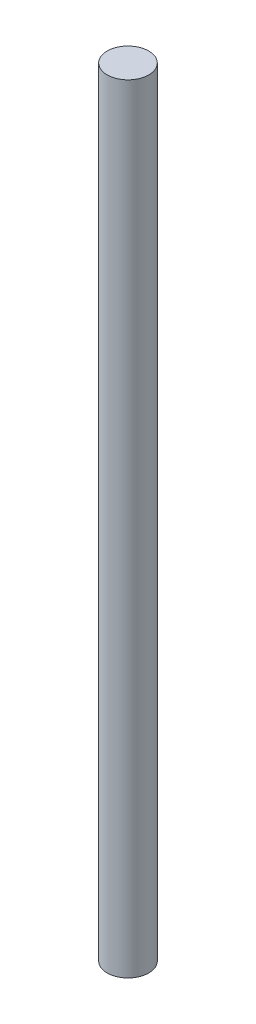
ISO-10303-21;
HEADER;
FILE_DESCRIPTION(('STEP AP214'),'2;1');
FILE_NAME('part.step','',(''),(''),'','','');
FILE_SCHEMA(('AUTOMOTIVE_DESIGN { 1 0 10303 214 1 1 1 1 }'));
ENDSEC;
DATA;
#1=APPLICATION_CONTEXT('core data for automotive mechanical design processes');
#2=APPLICATION_PROTOCOL_DEFINITION('international standard','automotive_design',2000,#1);
#3=PRODUCT_CONTEXT('',#1,'mechanical');
#4=PRODUCT('Part','Part','',(#3));
#5=PRODUCT_RELATED_PRODUCT_CATEGORY('part','',(#4));
#6=PRODUCT_DEFINITION_FORMATION('','',#4);
#7=PRODUCT_DEFINITION_CONTEXT('part definition',#1,'design');
#8=PRODUCT_DEFINITION('design','',#6,#7);
#9=PRODUCT_DEFINITION_SHAPE('','',#8);
#10=(LENGTH_UNIT() NAMED_UNIT(*) SI_UNIT(.MILLI.,.METRE.));
#11=(NAMED_UNIT(*) PLANE_ANGLE_UNIT() SI_UNIT($,.RADIAN.));
#12=(NAMED_UNIT(*) SI_UNIT($,.STERADIAN.) SOLID_ANGLE_UNIT());
#13=UNCERTAINTY_MEASURE_WITH_UNIT(LENGTH_MEASURE(1.E-05),#10,'distance_accuracy_value','');
#14=(GEOMETRIC_REPRESENTATION_CONTEXT(3) GLOBAL_UNCERTAINTY_ASSIGNED_CONTEXT((#13)) GLOBAL_UNIT_ASSIGNED_CONTEXT((#10,
#11,#12)) REPRESENTATION_CONTEXT('',''));
#15=CARTESIAN_POINT('',(0.,0.,0.));
#16=DIRECTION('',(0.,0.,1.));
#17=DIRECTION('',(1.,0.,0.));
#18=AXIS2_PLACEMENT_3D('',#15,#16,#17);
#19=CARTESIAN_POINT('',(0.,300.,0.));
#20=DIRECTION('',(0.,-1.,0.));
#21=DIRECTION('',(0.,0.,-1.));
#22=AXIS2_PLACEMENT_3D('',#19,#20,#21);
#23=CYLINDRICAL_SURFACE('',#22,8.);
#24=CARTESIAN_POINT('',(0.,300.,0.));
#25=DIRECTION('',(0.,1.,0.));
#26=DIRECTION('',(0.,0.,1.));
#27=AXIS2_PLACEMENT_3D('',#24,#25,#26);
#28=CIRCLE('',#27,8.);
#29=CARTESIAN_POINT('',(0.,300.,8.));
#30=VERTEX_POINT('',#29);
#31=EDGE_CURVE('E10',#30,#30,#28,.T.);
#32=ORIENTED_EDGE('',*,*,#31,.F.);
#33=EDGE_LOOP('',(#32));
#34=FACE_BOUND('',#33,.T.);
#35=CARTESIAN_POINT('',(0.,0.,0.));
#36=DIRECTION('',(0.,1.,0.));
#37=DIRECTION('',(0.,0.,1.));
#38=AXIS2_PLACEMENT_3D('',#35,#36,#37);
#39=CIRCLE('',#38,8.);
#40=CARTESIAN_POINT('',(0.,0.,8.));
#41=VERTEX_POINT('',#40);
#42=EDGE_CURVE('E36',#41,#41,#39,.T.);
#43=ORIENTED_EDGE('',*,*,#42,.T.);
#44=EDGE_LOOP('',(#43));
#45=FACE_BOUND('',#44,.T.);
#46=ADVANCED_FACE('F33',(#34,#45),#23,.T.);
#47=CARTESIAN_POINT('',(0.,300.,0.));
#48=DIRECTION('',(0.,1.,0.));
#49=DIRECTION('',(0.,0.,1.));
#50=AXIS2_PLACEMENT_3D('',#47,#48,#49);
#51=PLANE('',#50);
#52=ORIENTED_EDGE('',*,*,#31,.T.);
#53=EDGE_LOOP('',(#52));
#54=FACE_BOUND('',#53,.T.);
#55=ADVANCED_FACE('F48',(#54),#51,.T.);
#56=CARTESIAN_POINT('',(0.,0.,0.));
#57=DIRECTION('',(0.,1.,0.));
#58=DIRECTION('',(0.,0.,1.));
#59=AXIS2_PLACEMENT_3D('',#56,#57,#58);
#60=PLANE('',#59);
#61=ORIENTED_EDGE('',*,*,#42,.F.);
#62=EDGE_LOOP('',(#61));
#63=FACE_BOUND('',#62,.T.);
#64=ADVANCED_FACE('F46',(#63),#60,.F.);
#65=CLOSED_SHELL('',(#46,#55,#64));
#66=MANIFOLD_SOLID_BREP('B2',#65);
#67=ADVANCED_BREP_SHAPE_REPRESENTATION('',(#18,#66),#14);
#68=SHAPE_DEFINITION_REPRESENTATION(#9,#67);
ENDSEC;
END-ISO-10303-21;
